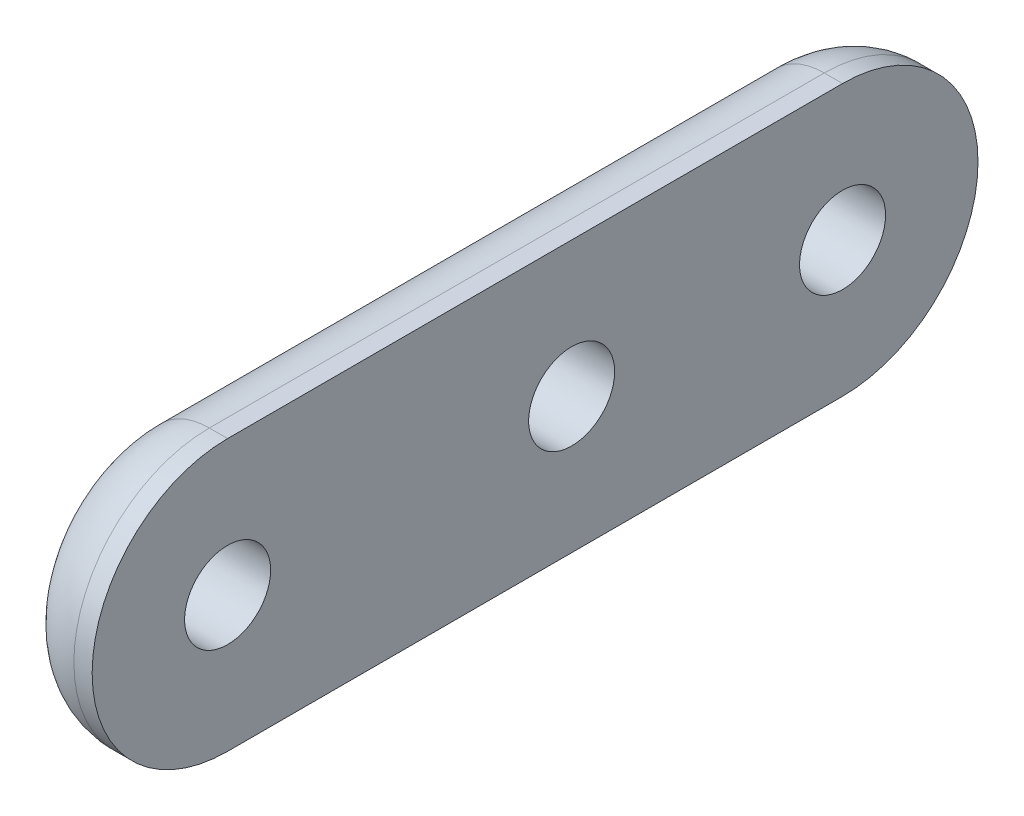
ISO-10303-21;
HEADER;
FILE_DESCRIPTION(('STEP AP214'),'2;1');
FILE_NAME('part.step','',(''),(''),'','','');
FILE_SCHEMA(('AUTOMOTIVE_DESIGN { 1 0 10303 214 1 1 1 1 }'));
ENDSEC;
DATA;
#1=APPLICATION_CONTEXT('core data for automotive mechanical design processes');
#2=APPLICATION_PROTOCOL_DEFINITION('international standard','automotive_design',2000,#1);
#3=PRODUCT_CONTEXT('',#1,'mechanical');
#4=PRODUCT('Part','Part','',(#3));
#5=PRODUCT_RELATED_PRODUCT_CATEGORY('part','',(#4));
#6=PRODUCT_DEFINITION_FORMATION('','',#4);
#7=PRODUCT_DEFINITION_CONTEXT('part definition',#1,'design');
#8=PRODUCT_DEFINITION('design','',#6,#7);
#9=PRODUCT_DEFINITION_SHAPE('','',#8);
#10=(LENGTH_UNIT() NAMED_UNIT(*) SI_UNIT(.MILLI.,.METRE.));
#11=(NAMED_UNIT(*) PLANE_ANGLE_UNIT() SI_UNIT($,.RADIAN.));
#12=(NAMED_UNIT(*) SI_UNIT($,.STERADIAN.) SOLID_ANGLE_UNIT());
#13=UNCERTAINTY_MEASURE_WITH_UNIT(LENGTH_MEASURE(1.E-05),#10,'distance_accuracy_value','');
#14=(GEOMETRIC_REPRESENTATION_CONTEXT(3) GLOBAL_UNCERTAINTY_ASSIGNED_CONTEXT((#13)) GLOBAL_UNIT_ASSIGNED_CONTEXT((#10,
#11,#12)) REPRESENTATION_CONTEXT('',''));
#15=CARTESIAN_POINT('',(0.,0.,0.));
#16=DIRECTION('',(0.,0.,1.));
#17=DIRECTION('',(1.,0.,0.));
#18=AXIS2_PLACEMENT_3D('',#15,#16,#17);
#19=CARTESIAN_POINT('',(6.35,0.,58.1764372815152));
#20=DIRECTION('',(1.,0.,0.));
#21=DIRECTION('',(0.,0.,-1.));
#22=AXIS2_PLACEMENT_3D('',#19,#20,#21);
#23=PLANE('',#22);
#24=CARTESIAN_POINT('',(6.35,0.,12.7764372815152));
#25=DIRECTION('',(1.,0.,0.));
#26=DIRECTION('',(0.,0.,-1.));
#27=AXIS2_PLACEMENT_3D('',#24,#25,#26);
#28=CIRCLE('',#27,3.175);
#29=CARTESIAN_POINT('',(6.35,0.,9.60143728151518));
#30=VERTEX_POINT('',#29);
#31=EDGE_CURVE('E147',#30,#30,#28,.T.);
#32=ORIENTED_EDGE('',*,*,#31,.F.);
#33=EDGE_LOOP('',(#32));
#34=FACE_BOUND('',#33,.T.);
#35=CARTESIAN_POINT('',(6.35,0.,58.1764372815152));
#36=DIRECTION('',(1.,0.,0.));
#37=DIRECTION('',(0.,0.,-1.));
#38=AXIS2_PLACEMENT_3D('',#35,#36,#37);
#39=CIRCLE('',#38,10.);
#40=CARTESIAN_POINT('',(6.35,10.,58.1764372815152));
#41=VERTEX_POINT('',#40);
#42=CARTESIAN_POINT('',(6.35,-10.,58.1764372815152));
#43=VERTEX_POINT('',#42);
#44=EDGE_CURVE('E96',#41,#43,#39,.T.);
#45=ORIENTED_EDGE('',*,*,#44,.T.);
#46=DIRECTION('',(0.,0.,-1.));
#47=VECTOR('',#46,1.);
#48=CARTESIAN_POINT('',(6.35,-10.,58.1764372815152));
#49=LINE('',#48,#47);
#50=CARTESIAN_POINT('',(6.35,-10.,12.7764372815152));
#51=VERTEX_POINT('',#50);
#52=EDGE_CURVE('E86',#43,#51,#49,.T.);
#53=ORIENTED_EDGE('',*,*,#52,.T.);
#54=CARTESIAN_POINT('',(6.35,0.,12.7764372815152));
#55=DIRECTION('',(1.,0.,0.));
#56=DIRECTION('',(0.,0.,-1.));
#57=AXIS2_PLACEMENT_3D('',#54,#55,#56);
#58=CIRCLE('',#57,10.);
#59=CARTESIAN_POINT('',(6.35,10.,12.7764372815152));
#60=VERTEX_POINT('',#59);
#61=EDGE_CURVE('E95',#51,#60,#58,.T.);
#62=ORIENTED_EDGE('',*,*,#61,.T.);
#63=DIRECTION('',(0.,0.,1.));
#64=VECTOR('',#63,1.);
#65=CARTESIAN_POINT('',(6.35,10.,58.1764372815152));
#66=LINE('',#65,#64);
#67=EDGE_CURVE('E101',#60,#41,#66,.T.);
#68=ORIENTED_EDGE('',*,*,#67,.T.);
#69=EDGE_LOOP('',(#45,#53,#62,#68));
#70=FACE_BOUND('',#69,.T.);
#71=CARTESIAN_POINT('',(6.35,0.,32.7764372815152));
#72=DIRECTION('',(1.,0.,0.));
#73=DIRECTION('',(0.,0.,-1.));
#74=AXIS2_PLACEMENT_3D('',#71,#72,#73);
#75=CIRCLE('',#74,3.175);
#76=CARTESIAN_POINT('',(6.35,0.,29.6014372815152));
#77=VERTEX_POINT('',#76);
#78=EDGE_CURVE('E102',#77,#77,#75,.T.);
#79=ORIENTED_EDGE('',*,*,#78,.F.);
#80=EDGE_LOOP('',(#79));
#81=FACE_BOUND('',#80,.T.);
#82=CARTESIAN_POINT('',(6.35,0.,58.1764372815152));
#83=DIRECTION('',(1.,0.,0.));
#84=DIRECTION('',(0.,0.,-1.));
#85=AXIS2_PLACEMENT_3D('',#82,#83,#84);
#86=CIRCLE('',#85,3.175);
#87=CARTESIAN_POINT('',(6.35,0.,55.0014372815152));
#88=VERTEX_POINT('',#87);
#89=EDGE_CURVE('E139',#88,#88,#86,.T.);
#90=ORIENTED_EDGE('',*,*,#89,.F.);
#91=EDGE_LOOP('',(#90));
#92=FACE_BOUND('',#91,.T.);
#93=ADVANCED_FACE('F32',(#34,#70,#81,#92),#23,.T.);
#94=CARTESIAN_POINT('',(0.,0.,58.1764372815152));
#95=DIRECTION('',(1.,0.,0.));
#96=DIRECTION('',(0.,0.,-1.));
#97=AXIS2_PLACEMENT_3D('',#94,#95,#96);
#98=PLANE('',#97);
#99=DIRECTION('',(0.,0.,1.));
#100=VECTOR('',#99,1.);
#101=CARTESIAN_POINT('',(0.,5.,58.1764372815152));
#102=LINE('',#101,#100);
#103=CARTESIAN_POINT('',(0.,5.,58.1764372815152));
#104=VERTEX_POINT('',#103);
#105=CARTESIAN_POINT('',(0.,5.,12.7764372815152));
#106=VERTEX_POINT('',#105);
#107=EDGE_CURVE('E108',#104,#106,#102,.F.);
#108=ORIENTED_EDGE('',*,*,#107,.T.);
#109=CARTESIAN_POINT('',(0.,0.,12.7764372815152));
#110=DIRECTION('',(1.,0.,0.));
#111=DIRECTION('',(0.,0.,-1.));
#112=AXIS2_PLACEMENT_3D('',#109,#110,#111);
#113=CIRCLE('',#112,5.);
#114=CARTESIAN_POINT('',(0.,-5.,12.7764372815152));
#115=VERTEX_POINT('',#114);
#116=EDGE_CURVE('E119',#106,#115,#113,.F.);
#117=ORIENTED_EDGE('',*,*,#116,.T.);
#118=DIRECTION('',(0.,0.,-1.));
#119=VECTOR('',#118,1.);
#120=CARTESIAN_POINT('',(0.,-5.,58.1764372815152));
#121=LINE('',#120,#119);
#122=CARTESIAN_POINT('',(0.,-5.,58.1764372815152));
#123=VERTEX_POINT('',#122);
#124=EDGE_CURVE('E117',#115,#123,#121,.F.);
#125=ORIENTED_EDGE('',*,*,#124,.T.);
#126=CARTESIAN_POINT('',(0.,0.,58.1764372815152));
#127=DIRECTION('',(1.,0.,0.));
#128=DIRECTION('',(0.,0.,-1.));
#129=AXIS2_PLACEMENT_3D('',#126,#127,#128);
#130=CIRCLE('',#129,5.);
#131=EDGE_CURVE('E115',#123,#104,#130,.F.);
#132=ORIENTED_EDGE('',*,*,#131,.T.);
#133=EDGE_LOOP('',(#108,#117,#125,#132));
#134=FACE_BOUND('',#133,.T.);
#135=CARTESIAN_POINT('',(0.,0.,12.7764372815152));
#136=DIRECTION('',(1.,0.,0.));
#137=DIRECTION('',(0.,0.,-1.));
#138=AXIS2_PLACEMENT_3D('',#135,#136,#137);
#139=CIRCLE('',#138,3.175);
#140=CARTESIAN_POINT('',(0.,0.,9.60143728151518));
#141=VERTEX_POINT('',#140);
#142=EDGE_CURVE('E144',#141,#141,#139,.T.);
#143=ORIENTED_EDGE('',*,*,#142,.T.);
#144=EDGE_LOOP('',(#143));
#145=FACE_BOUND('',#144,.T.);
#146=CARTESIAN_POINT('',(0.,0.,32.7764372815152));
#147=DIRECTION('',(1.,0.,0.));
#148=DIRECTION('',(0.,0.,-1.));
#149=AXIS2_PLACEMENT_3D('',#146,#147,#148);
#150=CIRCLE('',#149,3.175);
#151=CARTESIAN_POINT('',(0.,0.,29.6014372815152));
#152=VERTEX_POINT('',#151);
#153=EDGE_CURVE('E150',#152,#152,#150,.T.);
#154=ORIENTED_EDGE('',*,*,#153,.T.);
#155=EDGE_LOOP('',(#154));
#156=FACE_BOUND('',#155,.T.);
#157=CARTESIAN_POINT('',(0.,0.,58.1764372815152));
#158=DIRECTION('',(1.,0.,0.));
#159=DIRECTION('',(0.,0.,-1.));
#160=AXIS2_PLACEMENT_3D('',#157,#158,#159);
#161=CIRCLE('',#160,3.175);
#162=CARTESIAN_POINT('',(0.,0.,55.0014372815152));
#163=VERTEX_POINT('',#162);
#164=EDGE_CURVE('E134',#163,#163,#161,.T.);
#165=ORIENTED_EDGE('',*,*,#164,.T.);
#166=EDGE_LOOP('',(#165));
#167=FACE_BOUND('',#166,.T.);
#168=ADVANCED_FACE('F180',(#134,#145,#156,#167),#98,.F.);
#169=CARTESIAN_POINT('',(6.35,0.,58.1764372815152));
#170=DIRECTION('',(-1.,0.,0.));
#171=DIRECTION('',(0.,0.,1.));
#172=AXIS2_PLACEMENT_3D('',#169,#170,#171);
#173=CYLINDRICAL_SURFACE('',#172,10.);
#174=DIRECTION('',(-1.,0.,0.));
#175=VECTOR('',#174,1.);
#176=CARTESIAN_POINT('',(6.35,10.,58.1764372815152));
#177=LINE('',#176,#175);
#178=CARTESIAN_POINT('',(5.,10.,58.1764372815152));
#179=VERTEX_POINT('',#178);
#180=EDGE_CURVE('E159',#41,#179,#177,.T.);
#181=ORIENTED_EDGE('',*,*,#180,.T.);
#182=CARTESIAN_POINT('',(5.,0.,58.1764372815152));
#183=DIRECTION('',(1.,0.,0.));
#184=DIRECTION('',(0.,0.,-1.));
#185=AXIS2_PLACEMENT_3D('',#182,#183,#184);
#186=CIRCLE('',#185,10.);
#187=CARTESIAN_POINT('',(5.,-10.,58.1764372815152));
#188=VERTEX_POINT('',#187);
#189=EDGE_CURVE('E41',#179,#188,#186,.T.);
#190=ORIENTED_EDGE('',*,*,#189,.T.);
#191=DIRECTION('',(-1.,0.,0.));
#192=VECTOR('',#191,1.);
#193=CARTESIAN_POINT('',(6.35,-10.,58.1764372815152));
#194=LINE('',#193,#192);
#195=EDGE_CURVE('E89',#43,#188,#194,.T.);
#196=ORIENTED_EDGE('',*,*,#195,.F.);
#197=ORIENTED_EDGE('',*,*,#44,.F.);
#198=EDGE_LOOP('',(#181,#190,#196,#197));
#199=FACE_BOUND('',#198,.T.);
#200=ADVANCED_FACE('F104',(#199),#173,.T.);
#201=CARTESIAN_POINT('',(6.35,-10.,58.1764372815152));
#202=DIRECTION('',(0.,1.,0.));
#203=DIRECTION('',(0.,0.,1.));
#204=AXIS2_PLACEMENT_3D('',#201,#202,#203);
#205=PLANE('',#204);
#206=ORIENTED_EDGE('',*,*,#195,.T.);
#207=DIRECTION('',(0.,0.,-1.));
#208=VECTOR('',#207,1.);
#209=CARTESIAN_POINT('',(5.,-10.,58.1764372815152));
#210=LINE('',#209,#208);
#211=CARTESIAN_POINT('',(5.,-10.,12.7764372815152));
#212=VERTEX_POINT('',#211);
#213=EDGE_CURVE('E122',#188,#212,#210,.T.);
#214=ORIENTED_EDGE('',*,*,#213,.T.);
#215=DIRECTION('',(-1.,0.,0.));
#216=VECTOR('',#215,1.);
#217=CARTESIAN_POINT('',(6.35,-10.,12.7764372815152));
#218=LINE('',#217,#216);
#219=EDGE_CURVE('E92',#51,#212,#218,.T.);
#220=ORIENTED_EDGE('',*,*,#219,.F.);
#221=ORIENTED_EDGE('',*,*,#52,.F.);
#222=EDGE_LOOP('',(#206,#214,#220,#221));
#223=FACE_BOUND('',#222,.T.);
#224=ADVANCED_FACE('F88',(#223),#205,.F.);
#225=CARTESIAN_POINT('',(6.35,0.,12.7764372815152));
#226=DIRECTION('',(-1.,0.,0.));
#227=DIRECTION('',(0.,0.,1.));
#228=AXIS2_PLACEMENT_3D('',#225,#226,#227);
#229=CYLINDRICAL_SURFACE('',#228,10.);
#230=ORIENTED_EDGE('',*,*,#219,.T.);
#231=CARTESIAN_POINT('',(5.,0.,12.7764372815152));
#232=DIRECTION('',(1.,0.,0.));
#233=DIRECTION('',(0.,0.,-1.));
#234=AXIS2_PLACEMENT_3D('',#231,#232,#233);
#235=CIRCLE('',#234,10.);
#236=CARTESIAN_POINT('',(5.,10.,12.7764372815152));
#237=VERTEX_POINT('',#236);
#238=EDGE_CURVE('E105',#212,#237,#235,.T.);
#239=ORIENTED_EDGE('',*,*,#238,.T.);
#240=DIRECTION('',(-1.,0.,0.));
#241=VECTOR('',#240,1.);
#242=CARTESIAN_POINT('',(6.35,10.,12.7764372815152));
#243=LINE('',#242,#241);
#244=EDGE_CURVE('E110',#60,#237,#243,.T.);
#245=ORIENTED_EDGE('',*,*,#244,.F.);
#246=ORIENTED_EDGE('',*,*,#61,.F.);
#247=EDGE_LOOP('',(#230,#239,#245,#246));
#248=FACE_BOUND('',#247,.T.);
#249=ADVANCED_FACE('F163',(#248),#229,.T.);
#250=CARTESIAN_POINT('',(6.35,10.,58.1764372815152));
#251=DIRECTION('',(0.,-1.,0.));
#252=DIRECTION('',(0.,0.,-1.));
#253=AXIS2_PLACEMENT_3D('',#250,#251,#252);
#254=PLANE('',#253);
#255=ORIENTED_EDGE('',*,*,#244,.T.);
#256=DIRECTION('',(0.,0.,1.));
#257=VECTOR('',#256,1.);
#258=CARTESIAN_POINT('',(5.,10.,58.1764372815152));
#259=LINE('',#258,#257);
#260=EDGE_CURVE('E11',#237,#179,#259,.T.);
#261=ORIENTED_EDGE('',*,*,#260,.T.);
#262=ORIENTED_EDGE('',*,*,#180,.F.);
#263=ORIENTED_EDGE('',*,*,#67,.F.);
#264=EDGE_LOOP('',(#255,#261,#262,#263));
#265=FACE_BOUND('',#264,.T.);
#266=ADVANCED_FACE('F161',(#265),#254,.F.);
#267=CARTESIAN_POINT('',(6.35,0.,32.7764372815152));
#268=DIRECTION('',(-1.,0.,0.));
#269=DIRECTION('',(0.,0.,1.));
#270=AXIS2_PLACEMENT_3D('',#267,#268,#269);
#271=CYLINDRICAL_SURFACE('',#270,3.175);
#272=ORIENTED_EDGE('',*,*,#78,.T.);
#273=EDGE_LOOP('',(#272));
#274=FACE_BOUND('',#273,.T.);
#275=ORIENTED_EDGE('',*,*,#153,.F.);
#276=EDGE_LOOP('',(#275));
#277=FACE_BOUND('',#276,.T.);
#278=ADVANCED_FACE('F190',(#274,#277),#271,.F.);
#279=CARTESIAN_POINT('',(6.35,0.,12.7764372815152));
#280=DIRECTION('',(-1.,0.,0.));
#281=DIRECTION('',(0.,0.,1.));
#282=AXIS2_PLACEMENT_3D('',#279,#280,#281);
#283=CYLINDRICAL_SURFACE('',#282,3.175);
#284=ORIENTED_EDGE('',*,*,#31,.T.);
#285=EDGE_LOOP('',(#284));
#286=FACE_BOUND('',#285,.T.);
#287=ORIENTED_EDGE('',*,*,#142,.F.);
#288=EDGE_LOOP('',(#287));
#289=FACE_BOUND('',#288,.T.);
#290=ADVANCED_FACE('F223',(#286,#289),#283,.F.);
#291=CARTESIAN_POINT('',(6.35,0.,58.1764372815152));
#292=DIRECTION('',(-1.,0.,0.));
#293=DIRECTION('',(0.,0.,1.));
#294=AXIS2_PLACEMENT_3D('',#291,#292,#293);
#295=CYLINDRICAL_SURFACE('',#294,3.175);
#296=ORIENTED_EDGE('',*,*,#89,.T.);
#297=EDGE_LOOP('',(#296));
#298=FACE_BOUND('',#297,.T.);
#299=ORIENTED_EDGE('',*,*,#164,.F.);
#300=EDGE_LOOP('',(#299));
#301=FACE_BOUND('',#300,.T.);
#302=ADVANCED_FACE('F230',(#298,#301),#295,.F.);
#303=CARTESIAN_POINT('',(5.,0.,58.1764372815152));
#304=DIRECTION('',(1.,0.,0.));
#305=DIRECTION('',(0.,0.,-1.));
#306=AXIS2_PLACEMENT_3D('',#303,#304,#305);
#307=DEGENERATE_TOROIDAL_SURFACE('',#306,5.,5.,.T.);
#308=CARTESIAN_POINT('',(5.,5.,58.1764372815152));
#309=DIRECTION('',(0.,0.,-1.));
#310=DIRECTION('',(-1.,0.,0.));
#311=AXIS2_PLACEMENT_3D('',#308,#309,#310);
#312=CIRCLE('',#311,5.);
#313=EDGE_CURVE('E128',#104,#179,#312,.T.);
#314=ORIENTED_EDGE('',*,*,#313,.F.);
#315=ORIENTED_EDGE('',*,*,#131,.F.);
#316=CARTESIAN_POINT('',(5.,-5.,58.1764372815152));
#317=DIRECTION('',(0.,0.,-1.));
#318=DIRECTION('',(-1.,0.,0.));
#319=AXIS2_PLACEMENT_3D('',#316,#317,#318);
#320=CIRCLE('',#319,5.);
#321=EDGE_CURVE('E36',#188,#123,#320,.T.);
#322=ORIENTED_EDGE('',*,*,#321,.F.);
#323=ORIENTED_EDGE('',*,*,#189,.F.);
#324=EDGE_LOOP('',(#314,#315,#322,#323));
#325=FACE_BOUND('',#324,.T.);
#326=ADVANCED_FACE('F34',(#325),#307,.T.);
#327=CARTESIAN_POINT('',(5.,-5.,58.1764372815152));
#328=DIRECTION('',(0.,0.,-1.));
#329=DIRECTION('',(-1.,0.,0.));
#330=AXIS2_PLACEMENT_3D('',#327,#328,#329);
#331=CYLINDRICAL_SURFACE('',#330,5.);
#332=ORIENTED_EDGE('',*,*,#321,.T.);
#333=ORIENTED_EDGE('',*,*,#124,.F.);
#334=CARTESIAN_POINT('',(5.,-5.,12.7764372815152));
#335=DIRECTION('',(0.,0.,-1.));
#336=DIRECTION('',(-1.,0.,0.));
#337=AXIS2_PLACEMENT_3D('',#334,#335,#336);
#338=CIRCLE('',#337,5.);
#339=EDGE_CURVE('E127',#212,#115,#338,.T.);
#340=ORIENTED_EDGE('',*,*,#339,.F.);
#341=ORIENTED_EDGE('',*,*,#213,.F.);
#342=EDGE_LOOP('',(#332,#333,#340,#341));
#343=FACE_BOUND('',#342,.T.);
#344=ADVANCED_FACE('F172',(#343),#331,.T.);
#345=CARTESIAN_POINT('',(5.,5.,58.1764372815152));
#346=DIRECTION('',(0.,0.,1.));
#347=DIRECTION('',(1.,0.,0.));
#348=AXIS2_PLACEMENT_3D('',#345,#346,#347);
#349=CYLINDRICAL_SURFACE('',#348,5.);
#350=ORIENTED_EDGE('',*,*,#313,.T.);
#351=ORIENTED_EDGE('',*,*,#260,.F.);
#352=CARTESIAN_POINT('',(5.,5.,12.7764372815152));
#353=DIRECTION('',(0.,0.,-1.));
#354=DIRECTION('',(-1.,0.,0.));
#355=AXIS2_PLACEMENT_3D('',#352,#353,#354);
#356=CIRCLE('',#355,5.);
#357=EDGE_CURVE('E125',#106,#237,#356,.T.);
#358=ORIENTED_EDGE('',*,*,#357,.F.);
#359=ORIENTED_EDGE('',*,*,#107,.F.);
#360=EDGE_LOOP('',(#350,#351,#358,#359));
#361=FACE_BOUND('',#360,.T.);
#362=ADVANCED_FACE('F170',(#361),#349,.T.);
#363=CARTESIAN_POINT('',(5.,0.,12.7764372815152));
#364=DIRECTION('',(1.,0.,0.));
#365=DIRECTION('',(0.,0.,-1.));
#366=AXIS2_PLACEMENT_3D('',#363,#364,#365);
#367=DEGENERATE_TOROIDAL_SURFACE('',#366,5.,5.,.T.);
#368=ORIENTED_EDGE('',*,*,#339,.T.);
#369=ORIENTED_EDGE('',*,*,#116,.F.);
#370=ORIENTED_EDGE('',*,*,#357,.T.);
#371=ORIENTED_EDGE('',*,*,#238,.F.);
#372=EDGE_LOOP('',(#368,#369,#370,#371));
#373=FACE_BOUND('',#372,.T.);
#374=ADVANCED_FACE('F167',(#373),#367,.T.);
#375=CLOSED_SHELL('',(#93,#168,#200,#224,#249,#266,#278,#290,#302,#326,#344,#362,#374));
#376=MANIFOLD_SOLID_BREP('B2',#375);
#377=ADVANCED_BREP_SHAPE_REPRESENTATION('',(#18,#376),#14);
#378=SHAPE_DEFINITION_REPRESENTATION(#9,#377);
ENDSEC;
END-ISO-10303-21;
